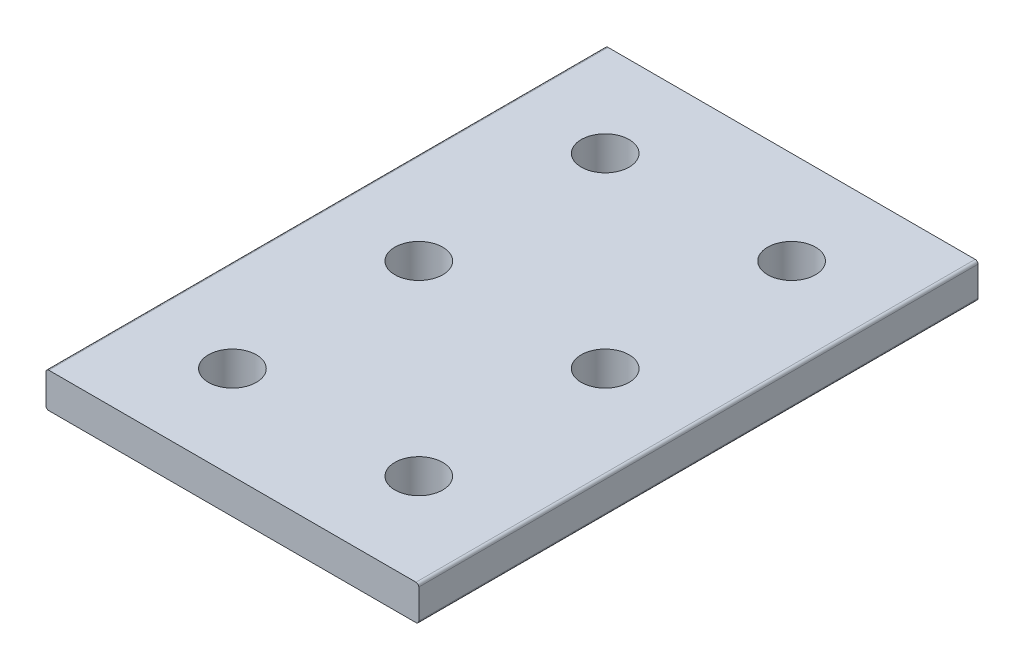
ISO-10303-21;
HEADER;
FILE_DESCRIPTION(('STEP AP214'),'2;1');
FILE_NAME('part.step','',(''),(''),'','','');
FILE_SCHEMA(('AUTOMOTIVE_DESIGN { 1 0 10303 214 1 1 1 1 }'));
ENDSEC;
DATA;
#1=APPLICATION_CONTEXT('core data for automotive mechanical design processes');
#2=APPLICATION_PROTOCOL_DEFINITION('international standard','automotive_design',2000,#1);
#3=PRODUCT_CONTEXT('',#1,'mechanical');
#4=PRODUCT('Part','Part','',(#3));
#5=PRODUCT_RELATED_PRODUCT_CATEGORY('part','',(#4));
#6=PRODUCT_DEFINITION_FORMATION('','',#4);
#7=PRODUCT_DEFINITION_CONTEXT('part definition',#1,'design');
#8=PRODUCT_DEFINITION('design','',#6,#7);
#9=PRODUCT_DEFINITION_SHAPE('','',#8);
#10=(LENGTH_UNIT() NAMED_UNIT(*) SI_UNIT(.MILLI.,.METRE.));
#11=(NAMED_UNIT(*) PLANE_ANGLE_UNIT() SI_UNIT($,.RADIAN.));
#12=(NAMED_UNIT(*) SI_UNIT($,.STERADIAN.) SOLID_ANGLE_UNIT());
#13=UNCERTAINTY_MEASURE_WITH_UNIT(LENGTH_MEASURE(1.E-05),#10,'distance_accuracy_value','');
#14=(GEOMETRIC_REPRESENTATION_CONTEXT(3) GLOBAL_UNCERTAINTY_ASSIGNED_CONTEXT((#13)) GLOBAL_UNIT_ASSIGNED_CONTEXT((#10,
#11,#12)) REPRESENTATION_CONTEXT('',''));
#15=CARTESIAN_POINT('',(0.,0.,0.));
#16=DIRECTION('',(0.,0.,1.));
#17=DIRECTION('',(1.,0.,0.));
#18=AXIS2_PLACEMENT_3D('',#15,#16,#17);
#19=CARTESIAN_POINT('',(0.,4.7752,76.2));
#20=DIRECTION('',(-1.,0.,0.));
#21=DIRECTION('',(0.,0.,1.));
#22=AXIS2_PLACEMENT_3D('',#19,#20,#21);
#23=PLANE('',#22);
#24=DIRECTION('',(0.,-1.,0.));
#25=VECTOR('',#24,1.);
#26=CARTESIAN_POINT('',(0.,4.7752,76.2));
#27=LINE('',#26,#25);
#28=CARTESIAN_POINT('',(0.,4.39420000000004,76.2));
#29=VERTEX_POINT('',#28);
#30=CARTESIAN_POINT('',(0.,0.380999999999964,76.2));
#31=VERTEX_POINT('',#30);
#32=EDGE_CURVE('E104',#29,#31,#27,.T.);
#33=ORIENTED_EDGE('',*,*,#32,.F.);
#34=DIRECTION('',(0.,0.,-1.));
#35=VECTOR('',#34,1.);
#36=CARTESIAN_POINT('',(0.,4.39420000000004,0.));
#37=LINE('',#36,#35);
#38=CARTESIAN_POINT('',(0.,4.39420000000004,0.));
#39=VERTEX_POINT('',#38);
#40=EDGE_CURVE('E116',#29,#39,#37,.T.);
#41=ORIENTED_EDGE('',*,*,#40,.T.);
#42=DIRECTION('',(0.,-1.,0.));
#43=VECTOR('',#42,1.);
#44=CARTESIAN_POINT('',(0.,4.7752,0.));
#45=LINE('',#44,#43);
#46=CARTESIAN_POINT('',(0.,0.380999999999964,0.));
#47=VERTEX_POINT('',#46);
#48=EDGE_CURVE('E168',#39,#47,#45,.T.);
#49=ORIENTED_EDGE('',*,*,#48,.T.);
#50=DIRECTION('',(0.,0.,-1.));
#51=VECTOR('',#50,1.);
#52=CARTESIAN_POINT('',(0.,0.380999999999964,76.2));
#53=LINE('',#52,#51);
#54=EDGE_CURVE('E119',#47,#31,#53,.F.);
#55=ORIENTED_EDGE('',*,*,#54,.T.);
#56=EDGE_LOOP('',(#33,#41,#49,#55));
#57=FACE_BOUND('',#56,.T.);
#58=ADVANCED_FACE('F34',(#57),#23,.T.);
#59=CARTESIAN_POINT('',(50.8,4.7752,76.2));
#60=DIRECTION('',(0.,0.,1.));
#61=DIRECTION('',(1.,0.,0.));
#62=AXIS2_PLACEMENT_3D('',#59,#60,#61);
#63=PLANE('',#62);
#64=DIRECTION('',(-1.,0.,0.));
#65=VECTOR('',#64,1.);
#66=CARTESIAN_POINT('',(50.8,4.7752,76.2));
#67=LINE('',#66,#65);
#68=CARTESIAN_POINT('',(50.419,4.7752,76.2));
#69=VERTEX_POINT('',#68);
#70=CARTESIAN_POINT('',(0.380999999999979,4.7752,76.2));
#71=VERTEX_POINT('',#70);
#72=EDGE_CURVE('E107',#69,#71,#67,.T.);
#73=ORIENTED_EDGE('',*,*,#72,.T.);
#74=CARTESIAN_POINT('',(0.380999999999964,4.39420000000004,76.2));
#75=DIRECTION('',(0.,0.,1.));
#76=DIRECTION('',(1.,0.,0.));
#77=AXIS2_PLACEMENT_3D('',#74,#75,#76);
#78=CIRCLE('',#77,0.380999999999964);
#79=EDGE_CURVE('E101',#71,#29,#78,.T.);
#80=ORIENTED_EDGE('',*,*,#79,.T.);
#81=ORIENTED_EDGE('',*,*,#32,.T.);
#82=CARTESIAN_POINT('',(0.380999999999964,0.380999999999964,76.2));
#83=DIRECTION('',(0.,0.,1.));
#84=DIRECTION('',(1.,0.,0.));
#85=AXIS2_PLACEMENT_3D('',#82,#83,#84);
#86=CIRCLE('',#85,0.380999999999964);
#87=CARTESIAN_POINT('',(0.380999999999979,0.,76.2));
#88=VERTEX_POINT('',#87);
#89=EDGE_CURVE('E140',#31,#88,#86,.T.);
#90=ORIENTED_EDGE('',*,*,#89,.T.);
#91=DIRECTION('',(-1.,0.,0.));
#92=VECTOR('',#91,1.);
#93=CARTESIAN_POINT('',(50.8,0.,76.2));
#94=LINE('',#93,#92);
#95=CARTESIAN_POINT('',(50.419,0.,76.2));
#96=VERTEX_POINT('',#95);
#97=EDGE_CURVE('E151',#96,#88,#94,.T.);
#98=ORIENTED_EDGE('',*,*,#97,.F.);
#99=CARTESIAN_POINT('',(50.419,0.380999999999964,76.2));
#100=DIRECTION('',(0.,0.,1.));
#101=DIRECTION('',(1.,0.,0.));
#102=AXIS2_PLACEMENT_3D('',#99,#100,#101);
#103=CIRCLE('',#102,0.380999999999964);
#104=CARTESIAN_POINT('',(50.8,0.380999999999964,76.2));
#105=VERTEX_POINT('',#104);
#106=EDGE_CURVE('E49',#96,#105,#103,.T.);
#107=ORIENTED_EDGE('',*,*,#106,.T.);
#108=DIRECTION('',(0.,-1.,0.));
#109=VECTOR('',#108,1.);
#110=CARTESIAN_POINT('',(50.8,4.7752,76.2));
#111=LINE('',#110,#109);
#112=CARTESIAN_POINT('',(50.8,4.39420000000004,76.2));
#113=VERTEX_POINT('',#112);
#114=EDGE_CURVE('E120',#113,#105,#111,.T.);
#115=ORIENTED_EDGE('',*,*,#114,.F.);
#116=CARTESIAN_POINT('',(50.419,4.39420000000004,76.2));
#117=DIRECTION('',(0.,0.,1.));
#118=DIRECTION('',(1.,0.,0.));
#119=AXIS2_PLACEMENT_3D('',#116,#117,#118);
#120=CIRCLE('',#119,0.380999999999964);
#121=EDGE_CURVE('E57',#113,#69,#120,.T.);
#122=ORIENTED_EDGE('',*,*,#121,.T.);
#123=EDGE_LOOP('',(#73,#80,#81,#90,#98,#107,#115,#122));
#124=FACE_BOUND('',#123,.T.);
#125=ADVANCED_FACE('F103',(#124),#63,.T.);
#126=CARTESIAN_POINT('',(50.8,4.7752,0.));
#127=DIRECTION('',(1.,0.,0.));
#128=DIRECTION('',(0.,0.,-1.));
#129=AXIS2_PLACEMENT_3D('',#126,#127,#128);
#130=PLANE('',#129);
#131=DIRECTION('',(0.,-1.,0.));
#132=VECTOR('',#131,1.);
#133=CARTESIAN_POINT('',(50.8,4.7752,0.));
#134=LINE('',#133,#132);
#135=CARTESIAN_POINT('',(50.8,4.39420000000004,0.));
#136=VERTEX_POINT('',#135);
#137=CARTESIAN_POINT('',(50.8,0.380999999999964,0.));
#138=VERTEX_POINT('',#137);
#139=EDGE_CURVE('E166',#136,#138,#134,.T.);
#140=ORIENTED_EDGE('',*,*,#139,.F.);
#141=DIRECTION('',(0.,0.,1.));
#142=VECTOR('',#141,1.);
#143=CARTESIAN_POINT('',(50.8,4.39420000000004,76.2));
#144=LINE('',#143,#142);
#145=EDGE_CURVE('E144',#136,#113,#144,.T.);
#146=ORIENTED_EDGE('',*,*,#145,.T.);
#147=ORIENTED_EDGE('',*,*,#114,.T.);
#148=DIRECTION('',(0.,0.,1.));
#149=VECTOR('',#148,1.);
#150=CARTESIAN_POINT('',(50.8,0.380999999999964,0.));
#151=LINE('',#150,#149);
#152=EDGE_CURVE('E111',#105,#138,#151,.F.);
#153=ORIENTED_EDGE('',*,*,#152,.T.);
#154=EDGE_LOOP('',(#140,#146,#147,#153));
#155=FACE_BOUND('',#154,.T.);
#156=ADVANCED_FACE('F236',(#155),#130,.T.);
#157=CARTESIAN_POINT('',(0.,4.7752,0.));
#158=DIRECTION('',(0.,0.,-1.));
#159=DIRECTION('',(-1.,0.,0.));
#160=AXIS2_PLACEMENT_3D('',#157,#158,#159);
#161=PLANE('',#160);
#162=ORIENTED_EDGE('',*,*,#48,.F.);
#163=CARTESIAN_POINT('',(0.380999999999964,4.39420000000004,0.));
#164=DIRECTION('',(0.,0.,-1.));
#165=DIRECTION('',(-1.,0.,0.));
#166=AXIS2_PLACEMENT_3D('',#163,#164,#165);
#167=CIRCLE('',#166,0.380999999999964);
#168=CARTESIAN_POINT('',(0.380999999999964,4.7752,0.));
#169=VERTEX_POINT('',#168);
#170=EDGE_CURVE('E123',#39,#169,#167,.T.);
#171=ORIENTED_EDGE('',*,*,#170,.T.);
#172=DIRECTION('',(1.,0.,0.));
#173=VECTOR('',#172,1.);
#174=CARTESIAN_POINT('',(0.,4.7752,0.));
#175=LINE('',#174,#173);
#176=CARTESIAN_POINT('',(50.419,4.7752,0.));
#177=VERTEX_POINT('',#176);
#178=EDGE_CURVE('E157',#169,#177,#175,.T.);
#179=ORIENTED_EDGE('',*,*,#178,.T.);
#180=CARTESIAN_POINT('',(50.419,4.39420000000004,0.));
#181=DIRECTION('',(0.,0.,-1.));
#182=DIRECTION('',(-1.,0.,0.));
#183=AXIS2_PLACEMENT_3D('',#180,#181,#182);
#184=CIRCLE('',#183,0.380999999999964);
#185=EDGE_CURVE('E132',#177,#136,#184,.T.);
#186=ORIENTED_EDGE('',*,*,#185,.T.);
#187=ORIENTED_EDGE('',*,*,#139,.T.);
#188=CARTESIAN_POINT('',(50.419,0.380999999999964,0.));
#189=DIRECTION('',(0.,0.,-1.));
#190=DIRECTION('',(-1.,0.,0.));
#191=AXIS2_PLACEMENT_3D('',#188,#189,#190);
#192=CIRCLE('',#191,0.380999999999964);
#193=CARTESIAN_POINT('',(50.419,0.,0.));
#194=VERTEX_POINT('',#193);
#195=EDGE_CURVE('E124',#138,#194,#192,.T.);
#196=ORIENTED_EDGE('',*,*,#195,.T.);
#197=DIRECTION('',(1.,0.,0.));
#198=VECTOR('',#197,1.);
#199=CARTESIAN_POINT('',(0.,0.,0.));
#200=LINE('',#199,#198);
#201=CARTESIAN_POINT('',(0.380999999999964,0.,0.));
#202=VERTEX_POINT('',#201);
#203=EDGE_CURVE('E154',#202,#194,#200,.T.);
#204=ORIENTED_EDGE('',*,*,#203,.F.);
#205=CARTESIAN_POINT('',(0.380999999999964,0.380999999999964,0.));
#206=DIRECTION('',(0.,0.,-1.));
#207=DIRECTION('',(-1.,0.,0.));
#208=AXIS2_PLACEMENT_3D('',#205,#206,#207);
#209=CIRCLE('',#208,0.380999999999964);
#210=EDGE_CURVE('E126',#202,#47,#209,.T.);
#211=ORIENTED_EDGE('',*,*,#210,.T.);
#212=EDGE_LOOP('',(#162,#171,#179,#186,#187,#196,#204,#211));
#213=FACE_BOUND('',#212,.T.);
#214=ADVANCED_FACE('F218',(#213),#161,.T.);
#215=CARTESIAN_POINT('',(0.,4.7752,0.));
#216=DIRECTION('',(0.,-1.,0.));
#217=DIRECTION('',(0.,0.,-1.));
#218=AXIS2_PLACEMENT_3D('',#215,#216,#217);
#219=PLANE('',#218);
#220=CARTESIAN_POINT('',(12.7,4.7752,12.7));
#221=DIRECTION('',(0.,1.,0.));
#222=DIRECTION('',(0.,0.,1.));
#223=AXIS2_PLACEMENT_3D('',#220,#221,#222);
#224=CIRCLE('',#223,3.2639);
#225=CARTESIAN_POINT('',(12.7,4.7752,15.9639));
#226=VERTEX_POINT('',#225);
#227=EDGE_CURVE('E199',#226,#226,#224,.T.);
#228=ORIENTED_EDGE('',*,*,#227,.F.);
#229=EDGE_LOOP('',(#228));
#230=FACE_BOUND('',#229,.T.);
#231=CARTESIAN_POINT('',(12.7,4.7752,38.1));
#232=DIRECTION('',(0.,1.,0.));
#233=DIRECTION('',(0.,0.,1.));
#234=AXIS2_PLACEMENT_3D('',#231,#232,#233);
#235=CIRCLE('',#234,3.2639);
#236=CARTESIAN_POINT('',(12.7,4.7752,41.3639));
#237=VERTEX_POINT('',#236);
#238=EDGE_CURVE('E193',#237,#237,#235,.T.);
#239=ORIENTED_EDGE('',*,*,#238,.F.);
#240=EDGE_LOOP('',(#239));
#241=FACE_BOUND('',#240,.T.);
#242=CARTESIAN_POINT('',(12.7,4.7752,63.5));
#243=DIRECTION('',(0.,1.,0.));
#244=DIRECTION('',(0.,0.,1.));
#245=AXIS2_PLACEMENT_3D('',#242,#243,#244);
#246=CIRCLE('',#245,3.2639);
#247=CARTESIAN_POINT('',(12.7,4.7752,66.7639));
#248=VERTEX_POINT('',#247);
#249=EDGE_CURVE('E187',#248,#248,#246,.T.);
#250=ORIENTED_EDGE('',*,*,#249,.F.);
#251=EDGE_LOOP('',(#250));
#252=FACE_BOUND('',#251,.T.);
#253=CARTESIAN_POINT('',(38.1,4.7752,12.7));
#254=DIRECTION('',(0.,1.,0.));
#255=DIRECTION('',(0.,0.,1.));
#256=AXIS2_PLACEMENT_3D('',#253,#254,#255);
#257=CIRCLE('',#256,3.2639);
#258=CARTESIAN_POINT('',(38.1,4.7752,15.9639));
#259=VERTEX_POINT('',#258);
#260=EDGE_CURVE('E181',#259,#259,#257,.T.);
#261=ORIENTED_EDGE('',*,*,#260,.F.);
#262=EDGE_LOOP('',(#261));
#263=FACE_BOUND('',#262,.T.);
#264=CARTESIAN_POINT('',(38.1,4.7752,38.1));
#265=DIRECTION('',(0.,1.,0.));
#266=DIRECTION('',(0.,0.,1.));
#267=AXIS2_PLACEMENT_3D('',#264,#265,#266);
#268=CIRCLE('',#267,3.2639);
#269=CARTESIAN_POINT('',(38.1,4.7752,41.3639));
#270=VERTEX_POINT('',#269);
#271=EDGE_CURVE('E175',#270,#270,#268,.T.);
#272=ORIENTED_EDGE('',*,*,#271,.F.);
#273=EDGE_LOOP('',(#272));
#274=FACE_BOUND('',#273,.T.);
#275=CARTESIAN_POINT('',(38.1,4.7752,63.5));
#276=DIRECTION('',(0.,1.,0.));
#277=DIRECTION('',(0.,0.,1.));
#278=AXIS2_PLACEMENT_3D('',#275,#276,#277);
#279=CIRCLE('',#278,3.2639);
#280=CARTESIAN_POINT('',(38.1,4.7752,66.7639));
#281=VERTEX_POINT('',#280);
#282=EDGE_CURVE('E172',#281,#281,#279,.T.);
#283=ORIENTED_EDGE('',*,*,#282,.F.);
#284=EDGE_LOOP('',(#283));
#285=FACE_BOUND('',#284,.T.);
#286=ORIENTED_EDGE('',*,*,#178,.F.);
#287=DIRECTION('',(0.,0.,-1.));
#288=VECTOR('',#287,1.);
#289=CARTESIAN_POINT('',(0.380999999999964,4.7752,76.2));
#290=LINE('',#289,#288);
#291=EDGE_CURVE('E137',#169,#71,#290,.F.);
#292=ORIENTED_EDGE('',*,*,#291,.T.);
#293=ORIENTED_EDGE('',*,*,#72,.F.);
#294=DIRECTION('',(0.,0.,1.));
#295=VECTOR('',#294,1.);
#296=CARTESIAN_POINT('',(50.419,4.7752,0.));
#297=LINE('',#296,#295);
#298=EDGE_CURVE('E135',#69,#177,#297,.F.);
#299=ORIENTED_EDGE('',*,*,#298,.T.);
#300=EDGE_LOOP('',(#286,#292,#293,#299));
#301=FACE_BOUND('',#300,.T.);
#302=ADVANCED_FACE('F215',(#230,#241,#252,#263,#274,#285,#301),#219,.F.);
#303=CARTESIAN_POINT('',(0.,0.,0.));
#304=DIRECTION('',(0.,-1.,0.));
#305=DIRECTION('',(0.,0.,-1.));
#306=AXIS2_PLACEMENT_3D('',#303,#304,#305);
#307=PLANE('',#306);
#308=CARTESIAN_POINT('',(12.7,0.,12.7));
#309=DIRECTION('',(0.,1.,0.));
#310=DIRECTION('',(0.,0.,1.));
#311=AXIS2_PLACEMENT_3D('',#308,#309,#310);
#312=CIRCLE('',#311,3.2639);
#313=CARTESIAN_POINT('',(12.7,0.,15.9639));
#314=VERTEX_POINT('',#313);
#315=EDGE_CURVE('E202',#314,#314,#312,.T.);
#316=ORIENTED_EDGE('',*,*,#315,.T.);
#317=EDGE_LOOP('',(#316));
#318=FACE_BOUND('',#317,.T.);
#319=CARTESIAN_POINT('',(12.7,0.,38.1));
#320=DIRECTION('',(0.,1.,0.));
#321=DIRECTION('',(0.,0.,1.));
#322=AXIS2_PLACEMENT_3D('',#319,#320,#321);
#323=CIRCLE('',#322,3.2639);
#324=CARTESIAN_POINT('',(12.7,0.,41.3639));
#325=VERTEX_POINT('',#324);
#326=EDGE_CURVE('E196',#325,#325,#323,.T.);
#327=ORIENTED_EDGE('',*,*,#326,.T.);
#328=EDGE_LOOP('',(#327));
#329=FACE_BOUND('',#328,.T.);
#330=CARTESIAN_POINT('',(12.7,0.,63.5));
#331=DIRECTION('',(0.,1.,0.));
#332=DIRECTION('',(0.,0.,1.));
#333=AXIS2_PLACEMENT_3D('',#330,#331,#332);
#334=CIRCLE('',#333,3.2639);
#335=CARTESIAN_POINT('',(12.7,0.,66.7639));
#336=VERTEX_POINT('',#335);
#337=EDGE_CURVE('E190',#336,#336,#334,.T.);
#338=ORIENTED_EDGE('',*,*,#337,.T.);
#339=EDGE_LOOP('',(#338));
#340=FACE_BOUND('',#339,.T.);
#341=CARTESIAN_POINT('',(38.1,0.,12.7));
#342=DIRECTION('',(0.,1.,0.));
#343=DIRECTION('',(0.,0.,1.));
#344=AXIS2_PLACEMENT_3D('',#341,#342,#343);
#345=CIRCLE('',#344,3.2639);
#346=CARTESIAN_POINT('',(38.1,0.,15.9639));
#347=VERTEX_POINT('',#346);
#348=EDGE_CURVE('E184',#347,#347,#345,.T.);
#349=ORIENTED_EDGE('',*,*,#348,.T.);
#350=EDGE_LOOP('',(#349));
#351=FACE_BOUND('',#350,.T.);
#352=CARTESIAN_POINT('',(38.1,0.,38.1));
#353=DIRECTION('',(0.,1.,0.));
#354=DIRECTION('',(0.,0.,1.));
#355=AXIS2_PLACEMENT_3D('',#352,#353,#354);
#356=CIRCLE('',#355,3.2639);
#357=CARTESIAN_POINT('',(38.1,0.,41.3639));
#358=VERTEX_POINT('',#357);
#359=EDGE_CURVE('E178',#358,#358,#356,.T.);
#360=ORIENTED_EDGE('',*,*,#359,.T.);
#361=EDGE_LOOP('',(#360));
#362=FACE_BOUND('',#361,.T.);
#363=CARTESIAN_POINT('',(38.1,0.,63.5));
#364=DIRECTION('',(0.,1.,0.));
#365=DIRECTION('',(0.,0.,1.));
#366=AXIS2_PLACEMENT_3D('',#363,#364,#365);
#367=CIRCLE('',#366,3.2639);
#368=CARTESIAN_POINT('',(38.1,0.,66.7639));
#369=VERTEX_POINT('',#368);
#370=EDGE_CURVE('E161',#369,#369,#367,.T.);
#371=ORIENTED_EDGE('',*,*,#370,.T.);
#372=EDGE_LOOP('',(#371));
#373=FACE_BOUND('',#372,.T.);
#374=ORIENTED_EDGE('',*,*,#97,.T.);
#375=DIRECTION('',(0.,0.,-1.));
#376=VECTOR('',#375,1.);
#377=CARTESIAN_POINT('',(0.380999999999964,0.,0.));
#378=LINE('',#377,#376);
#379=EDGE_CURVE('E11',#88,#202,#378,.T.);
#380=ORIENTED_EDGE('',*,*,#379,.T.);
#381=ORIENTED_EDGE('',*,*,#203,.T.);
#382=DIRECTION('',(0.,0.,1.));
#383=VECTOR('',#382,1.);
#384=CARTESIAN_POINT('',(50.419,0.,0.));
#385=LINE('',#384,#383);
#386=EDGE_CURVE('E42',#194,#96,#385,.T.);
#387=ORIENTED_EDGE('',*,*,#386,.T.);
#388=EDGE_LOOP('',(#374,#380,#381,#387));
#389=FACE_BOUND('',#388,.T.);
#390=ADVANCED_FACE('F150',(#318,#329,#340,#351,#362,#373,#389),#307,.T.);
#391=CARTESIAN_POINT('',(38.1,4.7752,63.5));
#392=DIRECTION('',(0.,1.,0.));
#393=DIRECTION('',(0.,0.,1.));
#394=AXIS2_PLACEMENT_3D('',#391,#392,#393);
#395=CYLINDRICAL_SURFACE('',#394,3.2639);
#396=ORIENTED_EDGE('',*,*,#370,.F.);
#397=EDGE_LOOP('',(#396));
#398=FACE_BOUND('',#397,.T.);
#399=ORIENTED_EDGE('',*,*,#282,.T.);
#400=EDGE_LOOP('',(#399));
#401=FACE_BOUND('',#400,.T.);
#402=ADVANCED_FACE('F260',(#398,#401),#395,.F.);
#403=CARTESIAN_POINT('',(0.380999999999964,4.39420000000004,76.2));
#404=DIRECTION('',(0.,0.,1.));
#405=DIRECTION('',(1.,0.,0.));
#406=AXIS2_PLACEMENT_3D('',#403,#404,#405);
#407=CYLINDRICAL_SURFACE('',#406,0.380999999999964);
#408=ORIENTED_EDGE('',*,*,#79,.F.);
#409=ORIENTED_EDGE('',*,*,#291,.F.);
#410=ORIENTED_EDGE('',*,*,#170,.F.);
#411=ORIENTED_EDGE('',*,*,#40,.F.);
#412=EDGE_LOOP('',(#408,#409,#410,#411));
#413=FACE_BOUND('',#412,.T.);
#414=ADVANCED_FACE('F122',(#413),#407,.T.);
#415=CARTESIAN_POINT('',(50.419,4.39420000000004,0.));
#416=DIRECTION('',(0.,0.,-1.));
#417=DIRECTION('',(-1.,0.,0.));
#418=AXIS2_PLACEMENT_3D('',#415,#416,#417);
#419=CYLINDRICAL_SURFACE('',#418,0.380999999999964);
#420=ORIENTED_EDGE('',*,*,#185,.F.);
#421=ORIENTED_EDGE('',*,*,#298,.F.);
#422=ORIENTED_EDGE('',*,*,#121,.F.);
#423=ORIENTED_EDGE('',*,*,#145,.F.);
#424=EDGE_LOOP('',(#420,#421,#422,#423));
#425=FACE_BOUND('',#424,.T.);
#426=ADVANCED_FACE('F234',(#425),#419,.T.);
#427=CARTESIAN_POINT('',(0.380999999999964,0.380999999999964,0.));
#428=DIRECTION('',(0.,0.,-1.));
#429=DIRECTION('',(-1.,0.,0.));
#430=AXIS2_PLACEMENT_3D('',#427,#428,#429);
#431=CYLINDRICAL_SURFACE('',#430,0.380999999999964);
#432=ORIENTED_EDGE('',*,*,#89,.F.);
#433=ORIENTED_EDGE('',*,*,#54,.F.);
#434=ORIENTED_EDGE('',*,*,#210,.F.);
#435=ORIENTED_EDGE('',*,*,#379,.F.);
#436=EDGE_LOOP('',(#432,#433,#434,#435));
#437=FACE_BOUND('',#436,.T.);
#438=ADVANCED_FACE('F240',(#437),#431,.T.);
#439=CARTESIAN_POINT('',(50.419,0.380999999999964,0.));
#440=DIRECTION('',(0.,0.,1.));
#441=DIRECTION('',(1.,0.,0.));
#442=AXIS2_PLACEMENT_3D('',#439,#440,#441);
#443=CYLINDRICAL_SURFACE('',#442,0.380999999999964);
#444=ORIENTED_EDGE('',*,*,#195,.F.);
#445=ORIENTED_EDGE('',*,*,#152,.F.);
#446=ORIENTED_EDGE('',*,*,#106,.F.);
#447=ORIENTED_EDGE('',*,*,#386,.F.);
#448=EDGE_LOOP('',(#444,#445,#446,#447));
#449=FACE_BOUND('',#448,.T.);
#450=ADVANCED_FACE('F36',(#449),#443,.T.);
#451=CARTESIAN_POINT('',(38.1,4.7752,38.1));
#452=DIRECTION('',(0.,1.,0.));
#453=DIRECTION('',(0.,0.,1.));
#454=AXIS2_PLACEMENT_3D('',#451,#452,#453);
#455=CYLINDRICAL_SURFACE('',#454,3.2639);
#456=ORIENTED_EDGE('',*,*,#359,.F.);
#457=EDGE_LOOP('',(#456));
#458=FACE_BOUND('',#457,.T.);
#459=ORIENTED_EDGE('',*,*,#271,.T.);
#460=EDGE_LOOP('',(#459));
#461=FACE_BOUND('',#460,.T.);
#462=ADVANCED_FACE('F239',(#458,#461),#455,.F.);
#463=CARTESIAN_POINT('',(38.1,4.7752,12.7));
#464=DIRECTION('',(0.,1.,0.));
#465=DIRECTION('',(0.,0.,1.));
#466=AXIS2_PLACEMENT_3D('',#463,#464,#465);
#467=CYLINDRICAL_SURFACE('',#466,3.2639);
#468=ORIENTED_EDGE('',*,*,#348,.F.);
#469=EDGE_LOOP('',(#468));
#470=FACE_BOUND('',#469,.T.);
#471=ORIENTED_EDGE('',*,*,#260,.T.);
#472=EDGE_LOOP('',(#471));
#473=FACE_BOUND('',#472,.T.);
#474=ADVANCED_FACE('F245',(#470,#473),#467,.F.);
#475=CARTESIAN_POINT('',(12.7,4.7752,63.5));
#476=DIRECTION('',(0.,1.,0.));
#477=DIRECTION('',(0.,0.,1.));
#478=AXIS2_PLACEMENT_3D('',#475,#476,#477);
#479=CYLINDRICAL_SURFACE('',#478,3.2639);
#480=ORIENTED_EDGE('',*,*,#337,.F.);
#481=EDGE_LOOP('',(#480));
#482=FACE_BOUND('',#481,.T.);
#483=ORIENTED_EDGE('',*,*,#249,.T.);
#484=EDGE_LOOP('',(#483));
#485=FACE_BOUND('',#484,.T.);
#486=ADVANCED_FACE('F307',(#482,#485),#479,.F.);
#487=CARTESIAN_POINT('',(12.7,4.7752,38.1));
#488=DIRECTION('',(0.,1.,0.));
#489=DIRECTION('',(0.,0.,1.));
#490=AXIS2_PLACEMENT_3D('',#487,#488,#489);
#491=CYLINDRICAL_SURFACE('',#490,3.2639);
#492=ORIENTED_EDGE('',*,*,#326,.F.);
#493=EDGE_LOOP('',(#492));
#494=FACE_BOUND('',#493,.T.);
#495=ORIENTED_EDGE('',*,*,#238,.T.);
#496=EDGE_LOOP('',(#495));
#497=FACE_BOUND('',#496,.T.);
#498=ADVANCED_FACE('F211',(#494,#497),#491,.F.);
#499=CARTESIAN_POINT('',(12.7,4.7752,12.7));
#500=DIRECTION('',(0.,1.,0.));
#501=DIRECTION('',(0.,0.,1.));
#502=AXIS2_PLACEMENT_3D('',#499,#500,#501);
#503=CYLINDRICAL_SURFACE('',#502,3.2639);
#504=ORIENTED_EDGE('',*,*,#315,.F.);
#505=EDGE_LOOP('',(#504));
#506=FACE_BOUND('',#505,.T.);
#507=ORIENTED_EDGE('',*,*,#227,.T.);
#508=EDGE_LOOP('',(#507));
#509=FACE_BOUND('',#508,.T.);
#510=ADVANCED_FACE('F208',(#506,#509),#503,.F.);
#511=CLOSED_SHELL('',(#58,#125,#156,#214,#302,#390,#402,#414,#426,#438,#450,#462,#474,#486,#498,#510));
#512=MANIFOLD_SOLID_BREP('B2',#511);
#513=ADVANCED_BREP_SHAPE_REPRESENTATION('',(#18,#512),#14);
#514=SHAPE_DEFINITION_REPRESENTATION(#9,#513);
ENDSEC;
END-ISO-10303-21;
